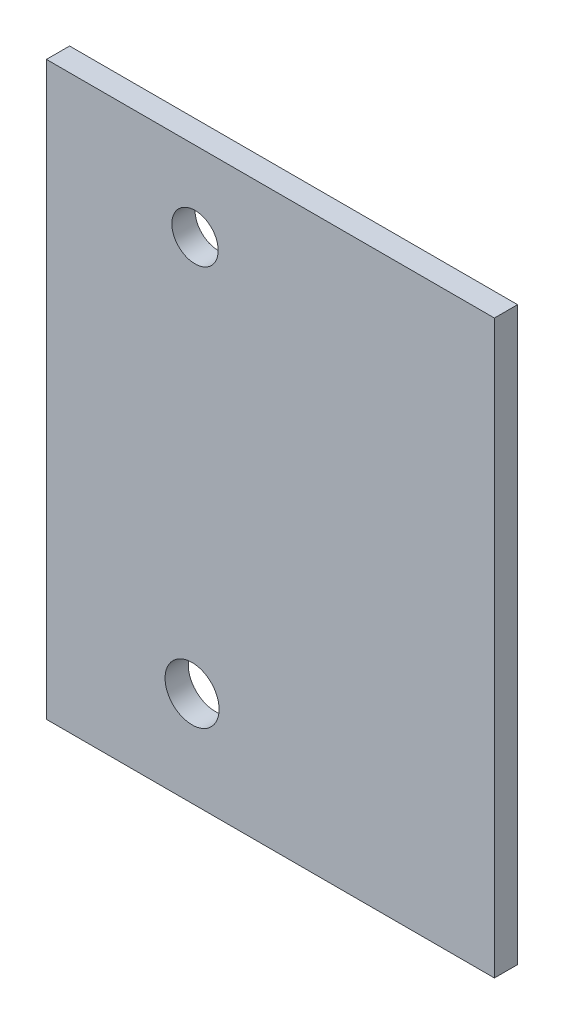
ISO-10303-21;
HEADER;
FILE_DESCRIPTION(('STEP AP214'),'2;1');
FILE_NAME('part.step','',(''),(''),'','','');
FILE_SCHEMA(('AUTOMOTIVE_DESIGN { 1 0 10303 214 1 1 1 1 }'));
ENDSEC;
DATA;
#1=APPLICATION_CONTEXT('core data for automotive mechanical design processes');
#2=APPLICATION_PROTOCOL_DEFINITION('international standard','automotive_design',2000,#1);
#3=PRODUCT_CONTEXT('',#1,'mechanical');
#4=PRODUCT('Part','Part','',(#3));
#5=PRODUCT_RELATED_PRODUCT_CATEGORY('part','',(#4));
#6=PRODUCT_DEFINITION_FORMATION('','',#4);
#7=PRODUCT_DEFINITION_CONTEXT('part definition',#1,'design');
#8=PRODUCT_DEFINITION('design','',#6,#7);
#9=PRODUCT_DEFINITION_SHAPE('','',#8);
#10=(LENGTH_UNIT() NAMED_UNIT(*) SI_UNIT(.MILLI.,.METRE.));
#11=(NAMED_UNIT(*) PLANE_ANGLE_UNIT() SI_UNIT($,.RADIAN.));
#12=(NAMED_UNIT(*) SI_UNIT($,.STERADIAN.) SOLID_ANGLE_UNIT());
#13=UNCERTAINTY_MEASURE_WITH_UNIT(LENGTH_MEASURE(1.E-05),#10,'distance_accuracy_value','');
#14=(GEOMETRIC_REPRESENTATION_CONTEXT(3) GLOBAL_UNCERTAINTY_ASSIGNED_CONTEXT((#13)) GLOBAL_UNIT_ASSIGNED_CONTEXT((#10,
#11,#12)) REPRESENTATION_CONTEXT('',''));
#15=CARTESIAN_POINT('',(0.,0.,0.));
#16=DIRECTION('',(0.,0.,1.));
#17=DIRECTION('',(1.,0.,0.));
#18=AXIS2_PLACEMENT_3D('',#15,#16,#17);
#19=CARTESIAN_POINT('',(0.,0.,1.5));
#20=DIRECTION('',(1.,0.,0.));
#21=DIRECTION('',(0.,0.,-1.));
#22=AXIS2_PLACEMENT_3D('',#19,#20,#21);
#23=PLANE('',#22);
#24=DIRECTION('',(0.,-1.,0.));
#25=VECTOR('',#24,1.);
#26=CARTESIAN_POINT('',(0.,0.,0.));
#27=LINE('',#26,#25);
#28=CARTESIAN_POINT('',(0.,37.,0.));
#29=VERTEX_POINT('',#28);
#30=CARTESIAN_POINT('',(0.,0.,0.));
#31=VERTEX_POINT('',#30);
#32=EDGE_CURVE('E98',#29,#31,#27,.T.);
#33=ORIENTED_EDGE('',*,*,#32,.T.);
#34=DIRECTION('',(0.,0.,-1.));
#35=VECTOR('',#34,1.);
#36=CARTESIAN_POINT('',(0.,0.,1.5));
#37=LINE('',#36,#35);
#38=CARTESIAN_POINT('',(0.,0.,1.5));
#39=VERTEX_POINT('',#38);
#40=EDGE_CURVE('E11',#39,#31,#37,.T.);
#41=ORIENTED_EDGE('',*,*,#40,.F.);
#42=DIRECTION('',(0.,-1.,0.));
#43=VECTOR('',#42,1.);
#44=CARTESIAN_POINT('',(0.,0.,1.5));
#45=LINE('',#44,#43);
#46=CARTESIAN_POINT('',(0.,37.,1.5));
#47=VERTEX_POINT('',#46);
#48=EDGE_CURVE('E86',#47,#39,#45,.T.);
#49=ORIENTED_EDGE('',*,*,#48,.F.);
#50=DIRECTION('',(0.,0.,-1.));
#51=VECTOR('',#50,1.);
#52=CARTESIAN_POINT('',(0.,37.,1.5));
#53=LINE('',#52,#51);
#54=EDGE_CURVE('E94',#47,#29,#53,.T.);
#55=ORIENTED_EDGE('',*,*,#54,.T.);
#56=EDGE_LOOP('',(#33,#41,#49,#55));
#57=FACE_BOUND('',#56,.T.);
#58=ADVANCED_FACE('F35',(#57),#23,.F.);
#59=CARTESIAN_POINT('',(0.,0.,1.5));
#60=DIRECTION('',(0.,1.,0.));
#61=DIRECTION('',(0.,0.,1.));
#62=AXIS2_PLACEMENT_3D('',#59,#60,#61);
#63=PLANE('',#62);
#64=DIRECTION('',(1.,0.,0.));
#65=VECTOR('',#64,1.);
#66=CARTESIAN_POINT('',(0.,0.,0.));
#67=LINE('',#66,#65);
#68=CARTESIAN_POINT('',(29.,0.,0.));
#69=VERTEX_POINT('',#68);
#70=EDGE_CURVE('E90',#31,#69,#67,.T.);
#71=ORIENTED_EDGE('',*,*,#70,.T.);
#72=DIRECTION('',(0.,0.,-1.));
#73=VECTOR('',#72,1.);
#74=CARTESIAN_POINT('',(29.,0.,1.5));
#75=LINE('',#74,#73);
#76=CARTESIAN_POINT('',(29.,0.,1.5));
#77=VERTEX_POINT('',#76);
#78=EDGE_CURVE('E43',#77,#69,#75,.T.);
#79=ORIENTED_EDGE('',*,*,#78,.F.);
#80=DIRECTION('',(1.,0.,0.));
#81=VECTOR('',#80,1.);
#82=CARTESIAN_POINT('',(0.,0.,1.5));
#83=LINE('',#82,#81);
#84=EDGE_CURVE('E81',#39,#77,#83,.T.);
#85=ORIENTED_EDGE('',*,*,#84,.F.);
#86=ORIENTED_EDGE('',*,*,#40,.T.);
#87=EDGE_LOOP('',(#71,#79,#85,#86));
#88=FACE_BOUND('',#87,.T.);
#89=ADVANCED_FACE('F89',(#88),#63,.F.);
#90=CARTESIAN_POINT('',(29.,0.,1.5));
#91=DIRECTION('',(-1.,0.,0.));
#92=DIRECTION('',(0.,0.,1.));
#93=AXIS2_PLACEMENT_3D('',#90,#91,#92);
#94=PLANE('',#93);
#95=DIRECTION('',(0.,1.,0.));
#96=VECTOR('',#95,1.);
#97=CARTESIAN_POINT('',(29.,0.,0.));
#98=LINE('',#97,#96);
#99=CARTESIAN_POINT('',(29.,37.,0.));
#100=VERTEX_POINT('',#99);
#101=EDGE_CURVE('E68',#69,#100,#98,.T.);
#102=ORIENTED_EDGE('',*,*,#101,.T.);
#103=DIRECTION('',(0.,0.,-1.));
#104=VECTOR('',#103,1.);
#105=CARTESIAN_POINT('',(29.,37.,1.5));
#106=LINE('',#105,#104);
#107=CARTESIAN_POINT('',(29.,37.,1.5));
#108=VERTEX_POINT('',#107);
#109=EDGE_CURVE('E91',#108,#100,#106,.T.);
#110=ORIENTED_EDGE('',*,*,#109,.F.);
#111=DIRECTION('',(0.,1.,0.));
#112=VECTOR('',#111,1.);
#113=CARTESIAN_POINT('',(29.,0.,1.5));
#114=LINE('',#113,#112);
#115=EDGE_CURVE('E84',#77,#108,#114,.T.);
#116=ORIENTED_EDGE('',*,*,#115,.F.);
#117=ORIENTED_EDGE('',*,*,#78,.T.);
#118=EDGE_LOOP('',(#102,#110,#116,#117));
#119=FACE_BOUND('',#118,.T.);
#120=ADVANCED_FACE('F92',(#119),#94,.F.);
#121=CARTESIAN_POINT('',(0.,37.,1.5));
#122=DIRECTION('',(0.,-1.,0.));
#123=DIRECTION('',(0.,0.,-1.));
#124=AXIS2_PLACEMENT_3D('',#121,#122,#123);
#125=PLANE('',#124);
#126=DIRECTION('',(-1.,0.,0.));
#127=VECTOR('',#126,1.);
#128=CARTESIAN_POINT('',(0.,37.,0.));
#129=LINE('',#128,#127);
#130=EDGE_CURVE('E74',#100,#29,#129,.T.);
#131=ORIENTED_EDGE('',*,*,#130,.T.);
#132=ORIENTED_EDGE('',*,*,#54,.F.);
#133=DIRECTION('',(-1.,0.,0.));
#134=VECTOR('',#133,1.);
#135=CARTESIAN_POINT('',(0.,37.,1.5));
#136=LINE('',#135,#134);
#137=EDGE_CURVE('E51',#108,#47,#136,.T.);
#138=ORIENTED_EDGE('',*,*,#137,.F.);
#139=ORIENTED_EDGE('',*,*,#109,.T.);
#140=EDGE_LOOP('',(#131,#132,#138,#139));
#141=FACE_BOUND('',#140,.T.);
#142=ADVANCED_FACE('F106',(#141),#125,.F.);
#143=CARTESIAN_POINT('',(0.,0.,1.5));
#144=DIRECTION('',(0.,0.,-1.));
#145=DIRECTION('',(-1.,0.,0.));
#146=AXIS2_PLACEMENT_3D('',#143,#144,#145);
#147=PLANE('',#146);
#148=CARTESIAN_POINT('',(9.4291,6.15396,1.5));
#149=DIRECTION('',(0.,0.,1.));
#150=DIRECTION('',(1.,0.,0.));
#151=AXIS2_PLACEMENT_3D('',#148,#149,#150);
#152=CIRCLE('',#151,1.75);
#153=CARTESIAN_POINT('',(11.1791,6.15396,1.5));
#154=VERTEX_POINT('',#153);
#155=EDGE_CURVE('E118',#154,#154,#152,.T.);
#156=ORIENTED_EDGE('',*,*,#155,.F.);
#157=EDGE_LOOP('',(#156));
#158=FACE_BOUND('',#157,.T.);
#159=CARTESIAN_POINT('',(9.62,31.845,1.5));
#160=DIRECTION('',(0.,0.,1.));
#161=DIRECTION('',(1.,0.,0.));
#162=AXIS2_PLACEMENT_3D('',#159,#160,#161);
#163=CIRCLE('',#162,1.5);
#164=CARTESIAN_POINT('',(11.12,31.845,1.5));
#165=VERTEX_POINT('',#164);
#166=EDGE_CURVE('E112',#165,#165,#163,.T.);
#167=ORIENTED_EDGE('',*,*,#166,.F.);
#168=EDGE_LOOP('',(#167));
#169=FACE_BOUND('',#168,.T.);
#170=ORIENTED_EDGE('',*,*,#48,.T.);
#171=ORIENTED_EDGE('',*,*,#84,.T.);
#172=ORIENTED_EDGE('',*,*,#115,.T.);
#173=ORIENTED_EDGE('',*,*,#137,.T.);
#174=EDGE_LOOP('',(#170,#171,#172,#173));
#175=FACE_BOUND('',#174,.T.);
#176=ADVANCED_FACE('F82',(#158,#169,#175),#147,.F.);
#177=CARTESIAN_POINT('',(0.,0.,0.));
#178=DIRECTION('',(0.,0.,-1.));
#179=DIRECTION('',(-1.,0.,0.));
#180=AXIS2_PLACEMENT_3D('',#177,#178,#179);
#181=PLANE('',#180);
#182=CARTESIAN_POINT('',(9.4291,6.15396,0.));
#183=DIRECTION('',(0.,0.,1.));
#184=DIRECTION('',(1.,0.,0.));
#185=AXIS2_PLACEMENT_3D('',#182,#183,#184);
#186=CIRCLE('',#185,1.75);
#187=CARTESIAN_POINT('',(11.1791,6.15396,0.));
#188=VERTEX_POINT('',#187);
#189=EDGE_CURVE('E115',#188,#188,#186,.T.);
#190=ORIENTED_EDGE('',*,*,#189,.T.);
#191=EDGE_LOOP('',(#190));
#192=FACE_BOUND('',#191,.T.);
#193=CARTESIAN_POINT('',(9.62,31.845,0.));
#194=DIRECTION('',(0.,0.,1.));
#195=DIRECTION('',(1.,0.,0.));
#196=AXIS2_PLACEMENT_3D('',#193,#194,#195);
#197=CIRCLE('',#196,1.5);
#198=CARTESIAN_POINT('',(11.12,31.845,0.));
#199=VERTEX_POINT('',#198);
#200=EDGE_CURVE('E101',#199,#199,#197,.T.);
#201=ORIENTED_EDGE('',*,*,#200,.T.);
#202=EDGE_LOOP('',(#201));
#203=FACE_BOUND('',#202,.T.);
#204=ORIENTED_EDGE('',*,*,#32,.F.);
#205=ORIENTED_EDGE('',*,*,#130,.F.);
#206=ORIENTED_EDGE('',*,*,#101,.F.);
#207=ORIENTED_EDGE('',*,*,#70,.F.);
#208=EDGE_LOOP('',(#204,#205,#206,#207));
#209=FACE_BOUND('',#208,.T.);
#210=ADVANCED_FACE('F109',(#192,#203,#209),#181,.T.);
#211=CARTESIAN_POINT('',(9.62,31.845,0.));
#212=DIRECTION('',(0.,0.,1.));
#213=DIRECTION('',(1.,0.,0.));
#214=AXIS2_PLACEMENT_3D('',#211,#212,#213);
#215=CYLINDRICAL_SURFACE('',#214,1.5);
#216=ORIENTED_EDGE('',*,*,#200,.F.);
#217=EDGE_LOOP('',(#216));
#218=FACE_BOUND('',#217,.T.);
#219=ORIENTED_EDGE('',*,*,#166,.T.);
#220=EDGE_LOOP('',(#219));
#221=FACE_BOUND('',#220,.T.);
#222=ADVANCED_FACE('F129',(#218,#221),#215,.F.);
#223=CARTESIAN_POINT('',(9.4291,6.15396,0.));
#224=DIRECTION('',(0.,0.,1.));
#225=DIRECTION('',(1.,0.,0.));
#226=AXIS2_PLACEMENT_3D('',#223,#224,#225);
#227=CYLINDRICAL_SURFACE('',#226,1.75);
#228=ORIENTED_EDGE('',*,*,#189,.F.);
#229=EDGE_LOOP('',(#228));
#230=FACE_BOUND('',#229,.T.);
#231=ORIENTED_EDGE('',*,*,#155,.T.);
#232=EDGE_LOOP('',(#231));
#233=FACE_BOUND('',#232,.T.);
#234=ADVANCED_FACE('F126',(#230,#233),#227,.F.);
#235=CLOSED_SHELL('',(#58,#89,#120,#142,#176,#210,#222,#234));
#236=MANIFOLD_SOLID_BREP('B2',#235);
#237=ADVANCED_BREP_SHAPE_REPRESENTATION('',(#18,#236),#14);
#238=SHAPE_DEFINITION_REPRESENTATION(#9,#237);
ENDSEC;
END-ISO-10303-21;
